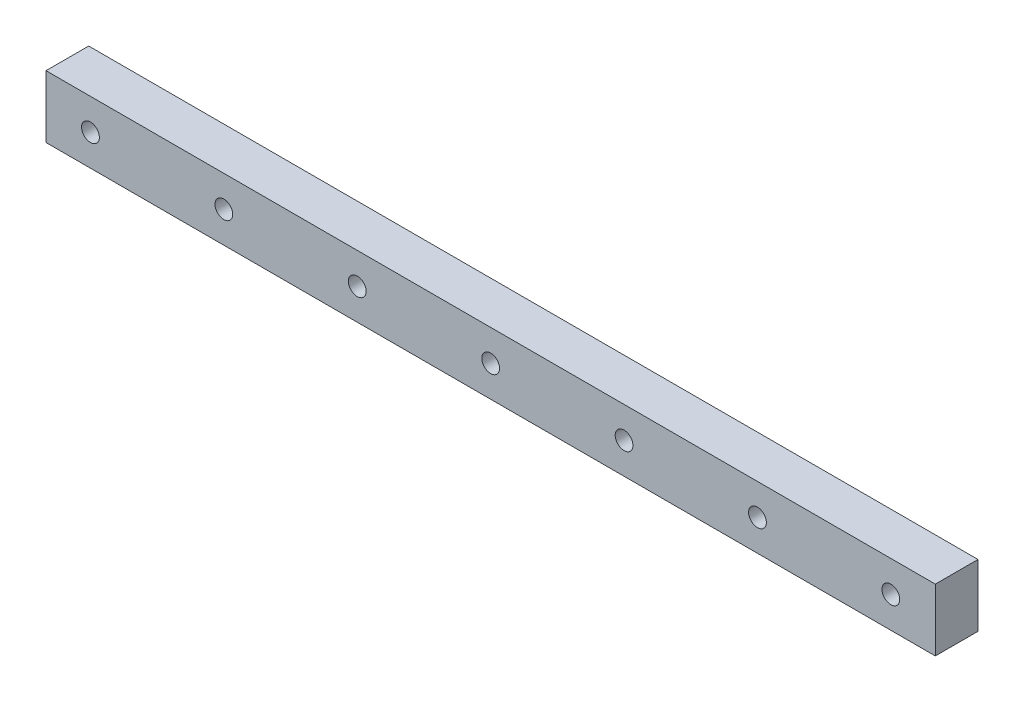
ISO-10303-21;
HEADER;
FILE_DESCRIPTION(('STEP AP214'),'2;1');
FILE_NAME('part.step','',(''),(''),'','','');
FILE_SCHEMA(('AUTOMOTIVE_DESIGN { 1 0 10303 214 1 1 1 1 }'));
ENDSEC;
DATA;
#1=APPLICATION_CONTEXT('core data for automotive mechanical design processes');
#2=APPLICATION_PROTOCOL_DEFINITION('international standard','automotive_design',2000,#1);
#3=PRODUCT_CONTEXT('',#1,'mechanical');
#4=PRODUCT('Part','Part','',(#3));
#5=PRODUCT_RELATED_PRODUCT_CATEGORY('part','',(#4));
#6=PRODUCT_DEFINITION_FORMATION('','',#4);
#7=PRODUCT_DEFINITION_CONTEXT('part definition',#1,'design');
#8=PRODUCT_DEFINITION('design','',#6,#7);
#9=PRODUCT_DEFINITION_SHAPE('','',#8);
#10=(LENGTH_UNIT() NAMED_UNIT(*) SI_UNIT(.MILLI.,.METRE.));
#11=(NAMED_UNIT(*) PLANE_ANGLE_UNIT() SI_UNIT($,.RADIAN.));
#12=(NAMED_UNIT(*) SI_UNIT($,.STERADIAN.) SOLID_ANGLE_UNIT());
#13=UNCERTAINTY_MEASURE_WITH_UNIT(LENGTH_MEASURE(1.E-05),#10,'distance_accuracy_value','');
#14=(GEOMETRIC_REPRESENTATION_CONTEXT(3) GLOBAL_UNCERTAINTY_ASSIGNED_CONTEXT((#13)) GLOBAL_UNIT_ASSIGNED_CONTEXT((#10,
#11,#12)) REPRESENTATION_CONTEXT('',''));
#15=CARTESIAN_POINT('',(0.,0.,0.));
#16=DIRECTION('',(0.,0.,1.));
#17=DIRECTION('',(1.,0.,0.));
#18=AXIS2_PLACEMENT_3D('',#15,#16,#17);
#19=CARTESIAN_POINT('',(0.,0.,4.8));
#20=DIRECTION('',(0.,0.,-1.));
#21=DIRECTION('',(-1.,0.,0.));
#22=AXIS2_PLACEMENT_3D('',#19,#20,#21);
#23=PLANE('',#22);
#24=DIRECTION('',(0.,-1.,0.));
#25=VECTOR('',#24,1.);
#26=CARTESIAN_POINT('',(0.,0.,4.8));
#27=LINE('',#26,#25);
#28=CARTESIAN_POINT('',(0.,7.,4.8));
#29=VERTEX_POINT('',#28);
#30=CARTESIAN_POINT('',(0.,0.,4.8));
#31=VERTEX_POINT('',#30);
#32=EDGE_CURVE('E92',#29,#31,#27,.T.);
#33=ORIENTED_EDGE('',*,*,#32,.T.);
#34=DIRECTION('',(1.,0.,0.));
#35=VECTOR('',#34,1.);
#36=CARTESIAN_POINT('',(0.,0.,4.8));
#37=LINE('',#36,#35);
#38=CARTESIAN_POINT('',(100.,0.,4.8));
#39=VERTEX_POINT('',#38);
#40=EDGE_CURVE('E87',#31,#39,#37,.T.);
#41=ORIENTED_EDGE('',*,*,#40,.T.);
#42=DIRECTION('',(0.,1.,0.));
#43=VECTOR('',#42,1.);
#44=CARTESIAN_POINT('',(100.,0.,4.8));
#45=LINE('',#44,#43);
#46=CARTESIAN_POINT('',(100.,7.,4.8));
#47=VERTEX_POINT('',#46);
#48=EDGE_CURVE('E90',#39,#47,#45,.T.);
#49=ORIENTED_EDGE('',*,*,#48,.T.);
#50=DIRECTION('',(-1.,0.,0.));
#51=VECTOR('',#50,1.);
#52=CARTESIAN_POINT('',(0.,7.,4.8));
#53=LINE('',#52,#51);
#54=EDGE_CURVE('E57',#47,#29,#53,.T.);
#55=ORIENTED_EDGE('',*,*,#54,.T.);
#56=EDGE_LOOP('',(#33,#41,#49,#55));
#57=FACE_BOUND('',#56,.T.);
#58=CARTESIAN_POINT('',(5.,3.5,4.8));
#59=DIRECTION('',(0.,0.,1.));
#60=DIRECTION('',(1.,0.,0.));
#61=AXIS2_PLACEMENT_3D('',#58,#59,#60);
#62=CIRCLE('',#61,1.);
#63=CARTESIAN_POINT('',(6.,3.5,4.8));
#64=VERTEX_POINT('',#63);
#65=EDGE_CURVE('E112',#64,#64,#62,.T.);
#66=ORIENTED_EDGE('',*,*,#65,.F.);
#67=EDGE_LOOP('',(#66));
#68=FACE_BOUND('',#67,.T.);
#69=CARTESIAN_POINT('',(20.,3.5,4.8));
#70=DIRECTION('',(0.,0.,1.));
#71=DIRECTION('',(1.,0.,0.));
#72=AXIS2_PLACEMENT_3D('',#69,#70,#71);
#73=CIRCLE('',#72,0.999999999999998);
#74=CARTESIAN_POINT('',(21.,3.5,4.8));
#75=VERTEX_POINT('',#74);
#76=EDGE_CURVE('E134',#75,#75,#73,.T.);
#77=ORIENTED_EDGE('',*,*,#76,.F.);
#78=EDGE_LOOP('',(#77));
#79=FACE_BOUND('',#78,.T.);
#80=CARTESIAN_POINT('',(35.,3.5,4.8));
#81=DIRECTION('',(0.,0.,1.));
#82=DIRECTION('',(1.,0.,0.));
#83=AXIS2_PLACEMENT_3D('',#80,#81,#82);
#84=CIRCLE('',#83,1.);
#85=CARTESIAN_POINT('',(36.,3.5,4.8));
#86=VERTEX_POINT('',#85);
#87=EDGE_CURVE('E142',#86,#86,#84,.T.);
#88=ORIENTED_EDGE('',*,*,#87,.F.);
#89=EDGE_LOOP('',(#88));
#90=FACE_BOUND('',#89,.T.);
#91=CARTESIAN_POINT('',(50.,3.5,4.8));
#92=DIRECTION('',(0.,0.,1.));
#93=DIRECTION('',(1.,0.,0.));
#94=AXIS2_PLACEMENT_3D('',#91,#92,#93);
#95=CIRCLE('',#94,1.);
#96=CARTESIAN_POINT('',(51.,3.5,4.8));
#97=VERTEX_POINT('',#96);
#98=EDGE_CURVE('E150',#97,#97,#95,.T.);
#99=ORIENTED_EDGE('',*,*,#98,.F.);
#100=EDGE_LOOP('',(#99));
#101=FACE_BOUND('',#100,.T.);
#102=CARTESIAN_POINT('',(65.,3.5,4.8));
#103=DIRECTION('',(0.,0.,1.));
#104=DIRECTION('',(1.,0.,0.));
#105=AXIS2_PLACEMENT_3D('',#102,#103,#104);
#106=CIRCLE('',#105,0.999999999999998);
#107=CARTESIAN_POINT('',(66.,3.5,4.8));
#108=VERTEX_POINT('',#107);
#109=EDGE_CURVE('E158',#108,#108,#106,.T.);
#110=ORIENTED_EDGE('',*,*,#109,.F.);
#111=EDGE_LOOP('',(#110));
#112=FACE_BOUND('',#111,.T.);
#113=CARTESIAN_POINT('',(80.,3.5,4.8));
#114=DIRECTION('',(0.,0.,1.));
#115=DIRECTION('',(1.,0.,0.));
#116=AXIS2_PLACEMENT_3D('',#113,#114,#115);
#117=CIRCLE('',#116,0.999999999999998);
#118=CARTESIAN_POINT('',(81.,3.5,4.8));
#119=VERTEX_POINT('',#118);
#120=EDGE_CURVE('E166',#119,#119,#117,.T.);
#121=ORIENTED_EDGE('',*,*,#120,.F.);
#122=EDGE_LOOP('',(#121));
#123=FACE_BOUND('',#122,.T.);
#124=CARTESIAN_POINT('',(95.,3.5,4.8));
#125=DIRECTION('',(0.,0.,1.));
#126=DIRECTION('',(1.,0.,0.));
#127=AXIS2_PLACEMENT_3D('',#124,#125,#126);
#128=CIRCLE('',#127,0.999999999999998);
#129=CARTESIAN_POINT('',(96.,3.5,4.8));
#130=VERTEX_POINT('',#129);
#131=EDGE_CURVE('E174',#130,#130,#128,.T.);
#132=ORIENTED_EDGE('',*,*,#131,.F.);
#133=EDGE_LOOP('',(#132));
#134=FACE_BOUND('',#133,.T.);
#135=ADVANCED_FACE('F39',(#57,#68,#79,#90,#101,#112,#123,#134),#23,.F.);
#136=CARTESIAN_POINT('',(0.,0.,0.));
#137=DIRECTION('',(0.,0.,-1.));
#138=DIRECTION('',(-1.,0.,0.));
#139=AXIS2_PLACEMENT_3D('',#136,#137,#138);
#140=PLANE('',#139);
#141=CARTESIAN_POINT('',(80.,3.5,0.));
#142=DIRECTION('',(0.,0.,1.));
#143=DIRECTION('',(1.,0.,0.));
#144=AXIS2_PLACEMENT_3D('',#141,#142,#143);
#145=CIRCLE('',#144,0.999999999999998);
#146=CARTESIAN_POINT('',(81.,3.5,0.));
#147=VERTEX_POINT('',#146);
#148=EDGE_CURVE('E170',#147,#147,#145,.T.);
#149=ORIENTED_EDGE('',*,*,#148,.T.);
#150=EDGE_LOOP('',(#149));
#151=FACE_BOUND('',#150,.T.);
#152=CARTESIAN_POINT('',(50.,3.5,0.));
#153=DIRECTION('',(0.,0.,1.));
#154=DIRECTION('',(1.,0.,0.));
#155=AXIS2_PLACEMENT_3D('',#152,#153,#154);
#156=CIRCLE('',#155,1.);
#157=CARTESIAN_POINT('',(51.,3.5,0.));
#158=VERTEX_POINT('',#157);
#159=EDGE_CURVE('E154',#158,#158,#156,.T.);
#160=ORIENTED_EDGE('',*,*,#159,.T.);
#161=EDGE_LOOP('',(#160));
#162=FACE_BOUND('',#161,.T.);
#163=CARTESIAN_POINT('',(20.,3.5,0.));
#164=DIRECTION('',(0.,0.,1.));
#165=DIRECTION('',(1.,0.,0.));
#166=AXIS2_PLACEMENT_3D('',#163,#164,#165);
#167=CIRCLE('',#166,0.999999999999998);
#168=CARTESIAN_POINT('',(21.,3.5,0.));
#169=VERTEX_POINT('',#168);
#170=EDGE_CURVE('E138',#169,#169,#167,.T.);
#171=ORIENTED_EDGE('',*,*,#170,.T.);
#172=EDGE_LOOP('',(#171));
#173=FACE_BOUND('',#172,.T.);
#174=DIRECTION('',(0.,-1.,0.));
#175=VECTOR('',#174,1.);
#176=CARTESIAN_POINT('',(0.,0.,0.));
#177=LINE('',#176,#175);
#178=CARTESIAN_POINT('',(0.,7.,0.));
#179=VERTEX_POINT('',#178);
#180=CARTESIAN_POINT('',(0.,0.,0.));
#181=VERTEX_POINT('',#180);
#182=EDGE_CURVE('E108',#179,#181,#177,.T.);
#183=ORIENTED_EDGE('',*,*,#182,.F.);
#184=DIRECTION('',(-1.,0.,0.));
#185=VECTOR('',#184,1.);
#186=CARTESIAN_POINT('',(0.,7.,0.));
#187=LINE('',#186,#185);
#188=CARTESIAN_POINT('',(100.,7.,0.));
#189=VERTEX_POINT('',#188);
#190=EDGE_CURVE('E80',#189,#179,#187,.T.);
#191=ORIENTED_EDGE('',*,*,#190,.F.);
#192=DIRECTION('',(0.,1.,0.));
#193=VECTOR('',#192,1.);
#194=CARTESIAN_POINT('',(100.,0.,0.));
#195=LINE('',#194,#193);
#196=CARTESIAN_POINT('',(100.,0.,0.));
#197=VERTEX_POINT('',#196);
#198=EDGE_CURVE('E74',#197,#189,#195,.T.);
#199=ORIENTED_EDGE('',*,*,#198,.F.);
#200=DIRECTION('',(1.,0.,0.));
#201=VECTOR('',#200,1.);
#202=CARTESIAN_POINT('',(0.,0.,0.));
#203=LINE('',#202,#201);
#204=EDGE_CURVE('E97',#181,#197,#203,.T.);
#205=ORIENTED_EDGE('',*,*,#204,.F.);
#206=EDGE_LOOP('',(#183,#191,#199,#205));
#207=FACE_BOUND('',#206,.T.);
#208=CARTESIAN_POINT('',(5.,3.5,0.));
#209=DIRECTION('',(0.,0.,1.));
#210=DIRECTION('',(1.,0.,0.));
#211=AXIS2_PLACEMENT_3D('',#208,#209,#210);
#212=CIRCLE('',#211,1.);
#213=CARTESIAN_POINT('',(6.,3.5,0.));
#214=VERTEX_POINT('',#213);
#215=EDGE_CURVE('E130',#214,#214,#212,.T.);
#216=ORIENTED_EDGE('',*,*,#215,.T.);
#217=EDGE_LOOP('',(#216));
#218=FACE_BOUND('',#217,.T.);
#219=CARTESIAN_POINT('',(35.,3.5,0.));
#220=DIRECTION('',(0.,0.,1.));
#221=DIRECTION('',(1.,0.,0.));
#222=AXIS2_PLACEMENT_3D('',#219,#220,#221);
#223=CIRCLE('',#222,1.);
#224=CARTESIAN_POINT('',(36.,3.5,0.));
#225=VERTEX_POINT('',#224);
#226=EDGE_CURVE('E146',#225,#225,#223,.T.);
#227=ORIENTED_EDGE('',*,*,#226,.T.);
#228=EDGE_LOOP('',(#227));
#229=FACE_BOUND('',#228,.T.);
#230=CARTESIAN_POINT('',(65.,3.5,0.));
#231=DIRECTION('',(0.,0.,1.));
#232=DIRECTION('',(1.,0.,0.));
#233=AXIS2_PLACEMENT_3D('',#230,#231,#232);
#234=CIRCLE('',#233,0.999999999999998);
#235=CARTESIAN_POINT('',(66.,3.5,0.));
#236=VERTEX_POINT('',#235);
#237=EDGE_CURVE('E162',#236,#236,#234,.T.);
#238=ORIENTED_EDGE('',*,*,#237,.T.);
#239=EDGE_LOOP('',(#238));
#240=FACE_BOUND('',#239,.T.);
#241=CARTESIAN_POINT('',(95.,3.5,0.));
#242=DIRECTION('',(0.,0.,1.));
#243=DIRECTION('',(1.,0.,0.));
#244=AXIS2_PLACEMENT_3D('',#241,#242,#243);
#245=CIRCLE('',#244,0.999999999999998);
#246=CARTESIAN_POINT('',(96.,3.5,0.));
#247=VERTEX_POINT('',#246);
#248=EDGE_CURVE('E178',#247,#247,#245,.T.);
#249=ORIENTED_EDGE('',*,*,#248,.T.);
#250=EDGE_LOOP('',(#249));
#251=FACE_BOUND('',#250,.T.);
#252=ADVANCED_FACE('F125',(#151,#162,#173,#207,#218,#229,#240,#251),#140,.T.);
#253=CARTESIAN_POINT('',(0.,0.,4.8));
#254=DIRECTION('',(1.,0.,0.));
#255=DIRECTION('',(0.,0.,-1.));
#256=AXIS2_PLACEMENT_3D('',#253,#254,#255);
#257=PLANE('',#256);
#258=ORIENTED_EDGE('',*,*,#182,.T.);
#259=DIRECTION('',(0.,0.,-1.));
#260=VECTOR('',#259,1.);
#261=CARTESIAN_POINT('',(0.,0.,4.8));
#262=LINE('',#261,#260);
#263=EDGE_CURVE('E11',#31,#181,#262,.T.);
#264=ORIENTED_EDGE('',*,*,#263,.F.);
#265=ORIENTED_EDGE('',*,*,#32,.F.);
#266=DIRECTION('',(0.,0.,-1.));
#267=VECTOR('',#266,1.);
#268=CARTESIAN_POINT('',(0.,7.,4.8));
#269=LINE('',#268,#267);
#270=EDGE_CURVE('E104',#29,#179,#269,.T.);
#271=ORIENTED_EDGE('',*,*,#270,.T.);
#272=EDGE_LOOP('',(#258,#264,#265,#271));
#273=FACE_BOUND('',#272,.T.);
#274=ADVANCED_FACE('F41',(#273),#257,.F.);
#275=CARTESIAN_POINT('',(0.,0.,4.8));
#276=DIRECTION('',(0.,1.,0.));
#277=DIRECTION('',(0.,0.,1.));
#278=AXIS2_PLACEMENT_3D('',#275,#276,#277);
#279=PLANE('',#278);
#280=ORIENTED_EDGE('',*,*,#204,.T.);
#281=DIRECTION('',(0.,0.,-1.));
#282=VECTOR('',#281,1.);
#283=CARTESIAN_POINT('',(100.,0.,4.8));
#284=LINE('',#283,#282);
#285=EDGE_CURVE('E49',#39,#197,#284,.T.);
#286=ORIENTED_EDGE('',*,*,#285,.F.);
#287=ORIENTED_EDGE('',*,*,#40,.F.);
#288=ORIENTED_EDGE('',*,*,#263,.T.);
#289=EDGE_LOOP('',(#280,#286,#287,#288));
#290=FACE_BOUND('',#289,.T.);
#291=ADVANCED_FACE('F96',(#290),#279,.F.);
#292=CARTESIAN_POINT('',(100.,0.,4.8));
#293=DIRECTION('',(-1.,0.,0.));
#294=DIRECTION('',(0.,0.,1.));
#295=AXIS2_PLACEMENT_3D('',#292,#293,#294);
#296=PLANE('',#295);
#297=ORIENTED_EDGE('',*,*,#198,.T.);
#298=DIRECTION('',(0.,0.,-1.));
#299=VECTOR('',#298,1.);
#300=CARTESIAN_POINT('',(100.,7.,4.8));
#301=LINE('',#300,#299);
#302=EDGE_CURVE('E99',#47,#189,#301,.T.);
#303=ORIENTED_EDGE('',*,*,#302,.F.);
#304=ORIENTED_EDGE('',*,*,#48,.F.);
#305=ORIENTED_EDGE('',*,*,#285,.T.);
#306=EDGE_LOOP('',(#297,#303,#304,#305));
#307=FACE_BOUND('',#306,.T.);
#308=ADVANCED_FACE('F100',(#307),#296,.F.);
#309=CARTESIAN_POINT('',(0.,7.,4.8));
#310=DIRECTION('',(0.,-1.,0.));
#311=DIRECTION('',(0.,0.,-1.));
#312=AXIS2_PLACEMENT_3D('',#309,#310,#311);
#313=PLANE('',#312);
#314=ORIENTED_EDGE('',*,*,#190,.T.);
#315=ORIENTED_EDGE('',*,*,#270,.F.);
#316=ORIENTED_EDGE('',*,*,#54,.F.);
#317=ORIENTED_EDGE('',*,*,#302,.T.);
#318=EDGE_LOOP('',(#314,#315,#316,#317));
#319=FACE_BOUND('',#318,.T.);
#320=ADVANCED_FACE('F122',(#319),#313,.F.);
#321=CARTESIAN_POINT('',(5.,3.5,4.8));
#322=DIRECTION('',(0.,0.,-1.));
#323=DIRECTION('',(-1.,0.,0.));
#324=AXIS2_PLACEMENT_3D('',#321,#322,#323);
#325=CYLINDRICAL_SURFACE('',#324,1.);
#326=ORIENTED_EDGE('',*,*,#65,.T.);
#327=EDGE_LOOP('',(#326));
#328=FACE_BOUND('',#327,.T.);
#329=ORIENTED_EDGE('',*,*,#215,.F.);
#330=EDGE_LOOP('',(#329));
#331=FACE_BOUND('',#330,.T.);
#332=ADVANCED_FACE('F197',(#328,#331),#325,.F.);
#333=CARTESIAN_POINT('',(20.,3.5,4.8));
#334=DIRECTION('',(0.,0.,-1.));
#335=DIRECTION('',(-1.,0.,0.));
#336=AXIS2_PLACEMENT_3D('',#333,#334,#335);
#337=CYLINDRICAL_SURFACE('',#336,0.999999999999998);
#338=ORIENTED_EDGE('',*,*,#76,.T.);
#339=EDGE_LOOP('',(#338));
#340=FACE_BOUND('',#339,.T.);
#341=ORIENTED_EDGE('',*,*,#170,.F.);
#342=EDGE_LOOP('',(#341));
#343=FACE_BOUND('',#342,.T.);
#344=ADVANCED_FACE('F243',(#340,#343),#337,.F.);
#345=CARTESIAN_POINT('',(35.,3.5,4.8));
#346=DIRECTION('',(0.,0.,-1.));
#347=DIRECTION('',(-1.,0.,0.));
#348=AXIS2_PLACEMENT_3D('',#345,#346,#347);
#349=CYLINDRICAL_SURFACE('',#348,1.);
#350=ORIENTED_EDGE('',*,*,#87,.T.);
#351=EDGE_LOOP('',(#350));
#352=FACE_BOUND('',#351,.T.);
#353=ORIENTED_EDGE('',*,*,#226,.F.);
#354=EDGE_LOOP('',(#353));
#355=FACE_BOUND('',#354,.T.);
#356=ADVANCED_FACE('F251',(#352,#355),#349,.F.);
#357=CARTESIAN_POINT('',(50.,3.5,4.8));
#358=DIRECTION('',(0.,0.,-1.));
#359=DIRECTION('',(-1.,0.,0.));
#360=AXIS2_PLACEMENT_3D('',#357,#358,#359);
#361=CYLINDRICAL_SURFACE('',#360,1.);
#362=ORIENTED_EDGE('',*,*,#98,.T.);
#363=EDGE_LOOP('',(#362));
#364=FACE_BOUND('',#363,.T.);
#365=ORIENTED_EDGE('',*,*,#159,.F.);
#366=EDGE_LOOP('',(#365));
#367=FACE_BOUND('',#366,.T.);
#368=ADVANCED_FACE('F259',(#364,#367),#361,.F.);
#369=CARTESIAN_POINT('',(65.,3.5,4.8));
#370=DIRECTION('',(0.,0.,-1.));
#371=DIRECTION('',(-1.,0.,0.));
#372=AXIS2_PLACEMENT_3D('',#369,#370,#371);
#373=CYLINDRICAL_SURFACE('',#372,0.999999999999998);
#374=ORIENTED_EDGE('',*,*,#109,.T.);
#375=EDGE_LOOP('',(#374));
#376=FACE_BOUND('',#375,.T.);
#377=ORIENTED_EDGE('',*,*,#237,.F.);
#378=EDGE_LOOP('',(#377));
#379=FACE_BOUND('',#378,.T.);
#380=ADVANCED_FACE('F268',(#376,#379),#373,.F.);
#381=CARTESIAN_POINT('',(80.,3.5,4.8));
#382=DIRECTION('',(0.,0.,-1.));
#383=DIRECTION('',(-1.,0.,0.));
#384=AXIS2_PLACEMENT_3D('',#381,#382,#383);
#385=CYLINDRICAL_SURFACE('',#384,0.999999999999998);
#386=ORIENTED_EDGE('',*,*,#120,.T.);
#387=EDGE_LOOP('',(#386));
#388=FACE_BOUND('',#387,.T.);
#389=ORIENTED_EDGE('',*,*,#148,.F.);
#390=EDGE_LOOP('',(#389));
#391=FACE_BOUND('',#390,.T.);
#392=ADVANCED_FACE('F277',(#388,#391),#385,.F.);
#393=CARTESIAN_POINT('',(95.,3.5,4.8));
#394=DIRECTION('',(0.,0.,-1.));
#395=DIRECTION('',(-1.,0.,0.));
#396=AXIS2_PLACEMENT_3D('',#393,#394,#395);
#397=CYLINDRICAL_SURFACE('',#396,0.999999999999998);
#398=ORIENTED_EDGE('',*,*,#131,.T.);
#399=EDGE_LOOP('',(#398));
#400=FACE_BOUND('',#399,.T.);
#401=ORIENTED_EDGE('',*,*,#248,.F.);
#402=EDGE_LOOP('',(#401));
#403=FACE_BOUND('',#402,.T.);
#404=ADVANCED_FACE('F186',(#400,#403),#397,.F.);
#405=CLOSED_SHELL('',(#135,#252,#274,#291,#308,#320,#332,#344,#356,#368,#380,#392,#404));
#406=MANIFOLD_SOLID_BREP('B2',#405);
#407=ADVANCED_BREP_SHAPE_REPRESENTATION('',(#18,#406),#14);
#408=SHAPE_DEFINITION_REPRESENTATION(#9,#407);
ENDSEC;
END-ISO-10303-21;
